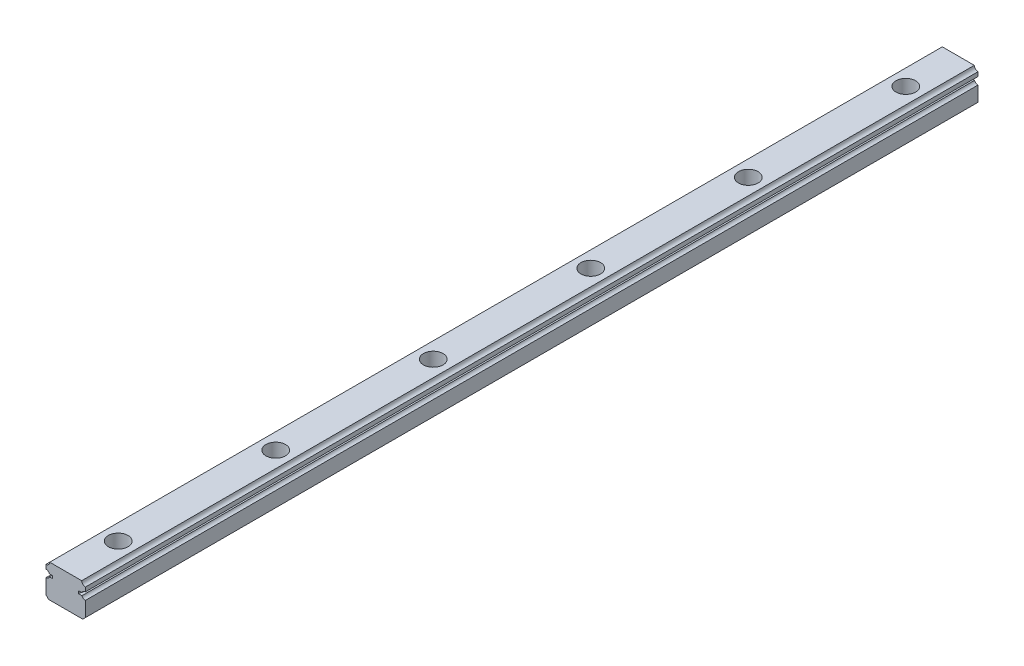
ISO-10303-21;
HEADER;
FILE_DESCRIPTION(('STEP AP214'),'2;1');
FILE_NAME('part.step','',(''),(''),'','','');
FILE_SCHEMA(('AUTOMOTIVE_DESIGN { 1 0 10303 214 1 1 1 1 }'));
ENDSEC;
DATA;
#1=APPLICATION_CONTEXT('core data for automotive mechanical design processes');
#2=APPLICATION_PROTOCOL_DEFINITION('international standard','automotive_design',2000,#1);
#3=PRODUCT_CONTEXT('',#1,'mechanical');
#4=PRODUCT('Part','Part','',(#3));
#5=PRODUCT_RELATED_PRODUCT_CATEGORY('part','',(#4));
#6=PRODUCT_DEFINITION_FORMATION('','',#4);
#7=PRODUCT_DEFINITION_CONTEXT('part definition',#1,'design');
#8=PRODUCT_DEFINITION('design','',#6,#7);
#9=PRODUCT_DEFINITION_SHAPE('','',#8);
#10=(LENGTH_UNIT() NAMED_UNIT(*) SI_UNIT(.MILLI.,.METRE.));
#11=(NAMED_UNIT(*) PLANE_ANGLE_UNIT() SI_UNIT($,.RADIAN.));
#12=(NAMED_UNIT(*) SI_UNIT($,.STERADIAN.) SOLID_ANGLE_UNIT());
#13=UNCERTAINTY_MEASURE_WITH_UNIT(LENGTH_MEASURE(1.E-05),#10,'distance_accuracy_value','');
#14=(GEOMETRIC_REPRESENTATION_CONTEXT(3) GLOBAL_UNCERTAINTY_ASSIGNED_CONTEXT((#13)) GLOBAL_UNIT_ASSIGNED_CONTEXT((#10,
#11,#12)) REPRESENTATION_CONTEXT('',''));
#15=CARTESIAN_POINT('',(0.,0.,0.));
#16=DIRECTION('',(0.,0.,1.));
#17=DIRECTION('',(1.,0.,0.));
#18=AXIS2_PLACEMENT_3D('',#15,#16,#17);
#19=CARTESIAN_POINT('',(-6.09998900000225,12.4999900000003,170.));
#20=DIRECTION('',(0.,-1.,0.));
#21=DIRECTION('',(1.,0.,0.));
#22=AXIS2_PLACEMENT_3D('',#19,#20,#21);
#23=PLANE('',#22);
#24=CARTESIAN_POINT('',(0.,12.4999900000003,29.9999999999999));
#25=DIRECTION('',(0.,1.,0.));
#26=DIRECTION('',(0.,0.,1.));
#27=AXIS2_PLACEMENT_3D('',#24,#25,#26);
#28=CIRCLE('',#27,3.74999999999998);
#29=CARTESIAN_POINT('',(0.,12.4999900000003,33.7499999999999));
#30=VERTEX_POINT('',#29);
#31=EDGE_CURVE('E784',#30,#30,#28,.T.);
#32=ORIENTED_EDGE('',*,*,#31,.F.);
#33=EDGE_LOOP('',(#32));
#34=FACE_BOUND('',#33,.T.);
#35=CARTESIAN_POINT('',(0.,12.4999900000003,-90.0000000000001));
#36=DIRECTION('',(0.,1.,0.));
#37=DIRECTION('',(0.,0.,1.));
#38=AXIS2_PLACEMENT_3D('',#35,#36,#37);
#39=CIRCLE('',#38,3.74999999999998);
#40=CARTESIAN_POINT('',(0.,12.4999900000003,-86.2500000000001));
#41=VERTEX_POINT('',#40);
#42=EDGE_CURVE('E813',#41,#41,#39,.T.);
#43=ORIENTED_EDGE('',*,*,#42,.F.);
#44=EDGE_LOOP('',(#43));
#45=FACE_BOUND('',#44,.T.);
#46=DIRECTION('',(-1.,0.,0.));
#47=VECTOR('',#46,1.);
#48=CARTESIAN_POINT('',(-6.09998900000225,12.4999900000003,-170.));
#49=LINE('',#48,#47);
#50=CARTESIAN_POINT('',(6.09998900000225,12.4999900000003,-170.));
#51=VERTEX_POINT('',#50);
#52=CARTESIAN_POINT('',(-6.09998900000225,12.4999900000003,-170.));
#53=VERTEX_POINT('',#52);
#54=EDGE_CURVE('E211',#51,#53,#49,.T.);
#55=ORIENTED_EDGE('',*,*,#54,.T.);
#56=DIRECTION('',(0.,0.,-1.));
#57=VECTOR('',#56,1.);
#58=CARTESIAN_POINT('',(-6.09998900000225,12.4999900000003,170.));
#59=LINE('',#58,#57);
#60=CARTESIAN_POINT('',(-6.09998900000225,12.4999900000003,170.));
#61=VERTEX_POINT('',#60);
#62=EDGE_CURVE('E282',#61,#53,#59,.T.);
#63=ORIENTED_EDGE('',*,*,#62,.F.);
#64=DIRECTION('',(-1.,0.,0.));
#65=VECTOR('',#64,1.);
#66=CARTESIAN_POINT('',(-6.09998900000225,12.4999900000003,170.));
#67=LINE('',#66,#65);
#68=CARTESIAN_POINT('',(6.09998900000225,12.4999900000003,170.));
#69=VERTEX_POINT('',#68);
#70=EDGE_CURVE('E311',#69,#61,#67,.T.);
#71=ORIENTED_EDGE('',*,*,#70,.F.);
#72=DIRECTION('',(0.,0.,-1.));
#73=VECTOR('',#72,1.);
#74=CARTESIAN_POINT('',(6.09998900000225,12.4999900000003,170.));
#75=LINE('',#74,#73);
#76=EDGE_CURVE('E285',#69,#51,#75,.T.);
#77=ORIENTED_EDGE('',*,*,#76,.T.);
#78=EDGE_LOOP('',(#55,#63,#71,#77));
#79=FACE_BOUND('',#78,.T.);
#80=CARTESIAN_POINT('',(0.,12.4999900000003,150.));
#81=DIRECTION('',(0.,-1.,0.));
#82=DIRECTION('',(0.,0.,-1.));
#83=AXIS2_PLACEMENT_3D('',#80,#81,#82);
#84=CIRCLE('',#83,3.74999999999998);
#85=CARTESIAN_POINT('',(0.,12.4999900000003,146.25));
#86=VERTEX_POINT('',#85);
#87=EDGE_CURVE('E207',#86,#86,#84,.T.);
#88=ORIENTED_EDGE('',*,*,#87,.T.);
#89=EDGE_LOOP('',(#88));
#90=FACE_BOUND('',#89,.T.);
#91=CARTESIAN_POINT('',(0.,12.4999900000003,-150.));
#92=DIRECTION('',(0.,1.,0.));
#93=DIRECTION('',(0.,0.,1.));
#94=AXIS2_PLACEMENT_3D('',#91,#92,#93);
#95=CIRCLE('',#94,3.74999999999998);
#96=CARTESIAN_POINT('',(0.,12.4999900000003,-146.25));
#97=VERTEX_POINT('',#96);
#98=EDGE_CURVE('E825',#97,#97,#95,.T.);
#99=ORIENTED_EDGE('',*,*,#98,.F.);
#100=EDGE_LOOP('',(#99));
#101=FACE_BOUND('',#100,.T.);
#102=CARTESIAN_POINT('',(0.,12.4999900000003,-30.0000000000001));
#103=DIRECTION('',(0.,1.,0.));
#104=DIRECTION('',(0.,0.,1.));
#105=AXIS2_PLACEMENT_3D('',#102,#103,#104);
#106=CIRCLE('',#105,3.74999999999998);
#107=CARTESIAN_POINT('',(0.,12.4999900000003,-26.2500000000001));
#108=VERTEX_POINT('',#107);
#109=EDGE_CURVE('E803',#108,#108,#106,.T.);
#110=ORIENTED_EDGE('',*,*,#109,.F.);
#111=EDGE_LOOP('',(#110));
#112=FACE_BOUND('',#111,.T.);
#113=CARTESIAN_POINT('',(0.,12.4999900000003,89.9999999999999));
#114=DIRECTION('',(0.,1.,0.));
#115=DIRECTION('',(0.,0.,1.));
#116=AXIS2_PLACEMENT_3D('',#113,#114,#115);
#117=CIRCLE('',#116,3.74999999999998);
#118=CARTESIAN_POINT('',(0.,12.4999900000003,93.7499999999999));
#119=VERTEX_POINT('',#118);
#120=EDGE_CURVE('E857',#119,#119,#117,.T.);
#121=ORIENTED_EDGE('',*,*,#120,.F.);
#122=EDGE_LOOP('',(#121));
#123=FACE_BOUND('',#122,.T.);
#124=ADVANCED_FACE('F34',(#34,#45,#79,#90,#101,#112,#123),#23,.F.);
#125=CARTESIAN_POINT('',(6.49996585786402,0.,170.));
#126=DIRECTION('',(0.,1.,0.));
#127=DIRECTION('',(0.,0.,1.));
#128=AXIS2_PLACEMENT_3D('',#125,#126,#127);
#129=PLANE('',#128);
#130=CARTESIAN_POINT('',(0.,0.,30.));
#131=DIRECTION('',(0.,1.,0.));
#132=DIRECTION('',(0.,0.,1.));
#133=AXIS2_PLACEMENT_3D('',#130,#131,#132);
#134=CIRCLE('',#133,2.24999999999997);
#135=CARTESIAN_POINT('',(0.,0.,32.2499999999999));
#136=VERTEX_POINT('',#135);
#137=EDGE_CURVE('E800',#136,#136,#134,.T.);
#138=ORIENTED_EDGE('',*,*,#137,.T.);
#139=EDGE_LOOP('',(#138));
#140=FACE_BOUND('',#139,.T.);
#141=CARTESIAN_POINT('',(0.,0.,-90.));
#142=DIRECTION('',(0.,1.,0.));
#143=DIRECTION('',(0.,0.,1.));
#144=AXIS2_PLACEMENT_3D('',#141,#142,#143);
#145=CIRCLE('',#144,2.24999999999997);
#146=CARTESIAN_POINT('',(0.,0.,-87.7500000000001));
#147=VERTEX_POINT('',#146);
#148=EDGE_CURVE('E822',#147,#147,#145,.T.);
#149=ORIENTED_EDGE('',*,*,#148,.T.);
#150=EDGE_LOOP('',(#149));
#151=FACE_BOUND('',#150,.T.);
#152=DIRECTION('',(1.,0.,0.));
#153=VECTOR('',#152,1.);
#154=CARTESIAN_POINT('',(6.49996585786402,0.,-170.));
#155=LINE('',#154,#153);
#156=CARTESIAN_POINT('',(-6.49996585786388,0.,-170.));
#157=VERTEX_POINT('',#156);
#158=CARTESIAN_POINT('',(6.49996585786402,0.,-170.));
#159=VERTEX_POINT('',#158);
#160=EDGE_CURVE('E231',#157,#159,#155,.T.);
#161=ORIENTED_EDGE('',*,*,#160,.T.);
#162=DIRECTION('',(0.,0.,-1.));
#163=VECTOR('',#162,1.);
#164=CARTESIAN_POINT('',(6.49996585786402,0.,170.));
#165=LINE('',#164,#163);
#166=CARTESIAN_POINT('',(6.49996585786402,0.,170.));
#167=VERTEX_POINT('',#166);
#168=EDGE_CURVE('E252',#167,#159,#165,.T.);
#169=ORIENTED_EDGE('',*,*,#168,.F.);
#170=DIRECTION('',(1.,0.,0.));
#171=VECTOR('',#170,1.);
#172=CARTESIAN_POINT('',(6.49996585786402,0.,170.));
#173=LINE('',#172,#171);
#174=CARTESIAN_POINT('',(-6.49996585786388,0.,170.));
#175=VERTEX_POINT('',#174);
#176=EDGE_CURVE('E331',#175,#167,#173,.T.);
#177=ORIENTED_EDGE('',*,*,#176,.F.);
#178=DIRECTION('',(0.,0.,-1.));
#179=VECTOR('',#178,1.);
#180=CARTESIAN_POINT('',(-6.49996585786388,0.,170.));
#181=LINE('',#180,#179);
#182=EDGE_CURVE('E255',#175,#157,#181,.T.);
#183=ORIENTED_EDGE('',*,*,#182,.T.);
#184=EDGE_LOOP('',(#161,#169,#177,#183));
#185=FACE_BOUND('',#184,.T.);
#186=CARTESIAN_POINT('',(0.,0.,150.));
#187=DIRECTION('',(0.,-1.,0.));
#188=DIRECTION('',(0.,0.,-1.));
#189=AXIS2_PLACEMENT_3D('',#186,#187,#188);
#190=CIRCLE('',#189,2.24999999999997);
#191=CARTESIAN_POINT('',(0.,0.,147.75));
#192=VERTEX_POINT('',#191);
#193=EDGE_CURVE('E771',#192,#192,#190,.T.);
#194=ORIENTED_EDGE('',*,*,#193,.F.);
#195=EDGE_LOOP('',(#194));
#196=FACE_BOUND('',#195,.T.);
#197=CARTESIAN_POINT('',(0.,0.,-150.));
#198=DIRECTION('',(0.,1.,0.));
#199=DIRECTION('',(0.,0.,1.));
#200=AXIS2_PLACEMENT_3D('',#197,#198,#199);
#201=CIRCLE('',#200,2.24999999999997);
#202=CARTESIAN_POINT('',(0.,0.,-147.75));
#203=VERTEX_POINT('',#202);
#204=EDGE_CURVE('E775',#203,#203,#201,.T.);
#205=ORIENTED_EDGE('',*,*,#204,.T.);
#206=EDGE_LOOP('',(#205));
#207=FACE_BOUND('',#206,.T.);
#208=CARTESIAN_POINT('',(0.,0.,-30.));
#209=DIRECTION('',(0.,1.,0.));
#210=DIRECTION('',(0.,0.,1.));
#211=AXIS2_PLACEMENT_3D('',#208,#209,#210);
#212=CIRCLE('',#211,2.24999999999997);
#213=CARTESIAN_POINT('',(0.,0.,-27.7500000000001));
#214=VERTEX_POINT('',#213);
#215=EDGE_CURVE('E779',#214,#214,#212,.T.);
#216=ORIENTED_EDGE('',*,*,#215,.T.);
#217=EDGE_LOOP('',(#216));
#218=FACE_BOUND('',#217,.T.);
#219=CARTESIAN_POINT('',(0.,0.,90.));
#220=DIRECTION('',(0.,1.,0.));
#221=DIRECTION('',(0.,0.,1.));
#222=AXIS2_PLACEMENT_3D('',#219,#220,#221);
#223=CIRCLE('',#222,2.24999999999997);
#224=CARTESIAN_POINT('',(0.,0.,92.2499999999999));
#225=VERTEX_POINT('',#224);
#226=EDGE_CURVE('E782',#225,#225,#223,.T.);
#227=ORIENTED_EDGE('',*,*,#226,.T.);
#228=EDGE_LOOP('',(#227));
#229=FACE_BOUND('',#228,.T.);
#230=ADVANCED_FACE('F360',(#140,#151,#185,#196,#207,#218,#229),#129,.F.);
#231=CARTESIAN_POINT('',(7.49999000000021,8.09999999996976,170.));
#232=DIRECTION('',(0.,0.,-1.));
#233=DIRECTION('',(-1.,0.,0.));
#234=AXIS2_PLACEMENT_3D('',#231,#232,#233);
#235=CYLINDRICAL_SURFACE('',#234,1.4);
#236=CARTESIAN_POINT('',(7.49999000000021,8.09999999996976,-170.));
#237=DIRECTION('',(0.,0.,-1.));
#238=DIRECTION('',(-1.,0.,0.));
#239=AXIS2_PLACEMENT_3D('',#236,#237,#238);
#240=CIRCLE('',#239,1.4);
#241=CARTESIAN_POINT('',(6.19232643481465,8.60001599999995,-170.));
#242=VERTEX_POINT('',#241);
#243=CARTESIAN_POINT('',(7.49998999999975,9.49999999996977,-170.));
#244=VERTEX_POINT('',#243);
#245=EDGE_CURVE('E203',#242,#244,#240,.T.);
#246=ORIENTED_EDGE('',*,*,#245,.T.);
#247=DIRECTION('',(0.,0.,-1.));
#248=VECTOR('',#247,1.);
#249=CARTESIAN_POINT('',(7.49998999999975,9.49999999996977,170.));
#250=LINE('',#249,#248);
#251=CARTESIAN_POINT('',(7.49998999999975,9.49999999996977,170.));
#252=VERTEX_POINT('',#251);
#253=EDGE_CURVE('E11',#252,#244,#250,.T.);
#254=ORIENTED_EDGE('',*,*,#253,.F.);
#255=CARTESIAN_POINT('',(7.49999000000021,8.09999999996976,170.));
#256=DIRECTION('',(0.,0.,-1.));
#257=DIRECTION('',(-1.,0.,0.));
#258=AXIS2_PLACEMENT_3D('',#255,#256,#257);
#259=CIRCLE('',#258,1.4);
#260=CARTESIAN_POINT('',(6.19232643481465,8.60001599999995,170.));
#261=VERTEX_POINT('',#260);
#262=EDGE_CURVE('E242',#261,#252,#259,.T.);
#263=ORIENTED_EDGE('',*,*,#262,.F.);
#264=DIRECTION('',(0.,0.,-1.));
#265=VECTOR('',#264,1.);
#266=CARTESIAN_POINT('',(6.19232643481465,8.60001599999995,170.));
#267=LINE('',#266,#265);
#268=EDGE_CURVE('E199',#261,#242,#267,.T.);
#269=ORIENTED_EDGE('',*,*,#268,.T.);
#270=EDGE_LOOP('',(#246,#254,#263,#269));
#271=FACE_BOUND('',#270,.T.);
#272=ADVANCED_FACE('F36',(#271),#235,.F.);
#273=CARTESIAN_POINT('',(7.49998999999975,11.0999740000294,170.));
#274=DIRECTION('',(-1.,0.,0.));
#275=DIRECTION('',(0.,-1.,0.));
#276=AXIS2_PLACEMENT_3D('',#273,#274,#275);
#277=PLANE('',#276);
#278=DIRECTION('',(0.,1.,0.));
#279=VECTOR('',#278,1.);
#280=CARTESIAN_POINT('',(7.49998999999975,11.0999740000294,-170.));
#281=LINE('',#280,#279);
#282=CARTESIAN_POINT('',(7.49998999999975,11.0999740000294,-170.));
#283=VERTEX_POINT('',#282);
#284=EDGE_CURVE('E206',#244,#283,#281,.T.);
#285=ORIENTED_EDGE('',*,*,#284,.T.);
#286=DIRECTION('',(0.,0.,-1.));
#287=VECTOR('',#286,1.);
#288=CARTESIAN_POINT('',(7.49998999999975,11.0999740000294,170.));
#289=LINE('',#288,#287);
#290=CARTESIAN_POINT('',(7.49998999999975,11.0999740000294,170.));
#291=VERTEX_POINT('',#290);
#292=EDGE_CURVE('E43',#291,#283,#289,.T.);
#293=ORIENTED_EDGE('',*,*,#292,.F.);
#294=DIRECTION('',(0.,1.,0.));
#295=VECTOR('',#294,1.);
#296=CARTESIAN_POINT('',(7.49998999999975,11.0999740000294,170.));
#297=LINE('',#296,#295);
#298=EDGE_CURVE('E130',#252,#291,#297,.T.);
#299=ORIENTED_EDGE('',*,*,#298,.F.);
#300=ORIENTED_EDGE('',*,*,#253,.T.);
#301=EDGE_LOOP('',(#285,#293,#299,#300));
#302=FACE_BOUND('',#301,.T.);
#303=ADVANCED_FACE('F374',(#302),#277,.F.);
#304=CARTESIAN_POINT('',(7.49999999999328,12.4999849999937,170.));
#305=DIRECTION('',(0.,0.,-1.));
#306=DIRECTION('',(-1.,0.,0.));
#307=AXIS2_PLACEMENT_3D('',#304,#305,#306);
#308=CYLINDRICAL_SURFACE('',#307,1.40001099999996);
#309=CARTESIAN_POINT('',(7.49999999999328,12.4999849999937,-170.));
#310=DIRECTION('',(0.,0.,-1.));
#311=DIRECTION('',(-1.,0.,0.));
#312=AXIS2_PLACEMENT_3D('',#309,#310,#311);
#313=CIRCLE('',#312,1.40001099999996);
#314=EDGE_CURVE('E209',#283,#51,#313,.T.);
#315=ORIENTED_EDGE('',*,*,#314,.T.);
#316=ORIENTED_EDGE('',*,*,#76,.F.);
#317=CARTESIAN_POINT('',(7.49999999999328,12.4999849999937,170.));
#318=DIRECTION('',(0.,0.,-1.));
#319=DIRECTION('',(-1.,0.,0.));
#320=AXIS2_PLACEMENT_3D('',#317,#318,#319);
#321=CIRCLE('',#320,1.40001099999996);
#322=EDGE_CURVE('E293',#291,#69,#321,.T.);
#323=ORIENTED_EDGE('',*,*,#322,.F.);
#324=ORIENTED_EDGE('',*,*,#292,.T.);
#325=EDGE_LOOP('',(#315,#316,#323,#324));
#326=FACE_BOUND('',#325,.T.);
#327=ADVANCED_FACE('F291',(#326),#308,.F.);
#328=CARTESIAN_POINT('',(-7.49999999999333,12.4999849999938,170.));
#329=DIRECTION('',(0.,0.,-1.));
#330=DIRECTION('',(-1.,0.,0.));
#331=AXIS2_PLACEMENT_3D('',#328,#329,#330);
#332=CYLINDRICAL_SURFACE('',#331,1.40001100000001);
#333=CARTESIAN_POINT('',(-7.49999999999333,12.4999849999938,-170.));
#334=DIRECTION('',(0.,0.,-1.));
#335=DIRECTION('',(-1.,0.,0.));
#336=AXIS2_PLACEMENT_3D('',#333,#334,#335);
#337=CIRCLE('',#336,1.40001100000001);
#338=CARTESIAN_POINT('',(-7.49998999999979,11.0999740000295,-170.));
#339=VERTEX_POINT('',#338);
#340=EDGE_CURVE('E213',#53,#339,#337,.T.);
#341=ORIENTED_EDGE('',*,*,#340,.T.);
#342=DIRECTION('',(0.,0.,-1.));
#343=VECTOR('',#342,1.);
#344=CARTESIAN_POINT('',(-7.49998999999979,11.0999740000295,170.));
#345=LINE('',#344,#343);
#346=CARTESIAN_POINT('',(-7.49998999999979,11.0999740000295,170.));
#347=VERTEX_POINT('',#346);
#348=EDGE_CURVE('E279',#347,#339,#345,.T.);
#349=ORIENTED_EDGE('',*,*,#348,.F.);
#350=CARTESIAN_POINT('',(-7.49999999999333,12.4999849999938,170.));
#351=DIRECTION('',(0.,0.,-1.));
#352=DIRECTION('',(-1.,0.,0.));
#353=AXIS2_PLACEMENT_3D('',#350,#351,#352);
#354=CIRCLE('',#353,1.40001100000001);
#355=EDGE_CURVE('E308',#61,#347,#354,.T.);
#356=ORIENTED_EDGE('',*,*,#355,.F.);
#357=ORIENTED_EDGE('',*,*,#62,.T.);
#358=EDGE_LOOP('',(#341,#349,#356,#357));
#359=FACE_BOUND('',#358,.T.);
#360=ADVANCED_FACE('F306',(#359),#332,.F.);
#361=CARTESIAN_POINT('',(-7.49998999999981,9.49999999994918,170.));
#362=DIRECTION('',(1.,0.,0.));
#363=DIRECTION('',(0.,1.,0.));
#364=AXIS2_PLACEMENT_3D('',#361,#362,#363);
#365=PLANE('',#364);
#366=DIRECTION('',(0.,-1.,0.));
#367=VECTOR('',#366,1.);
#368=CARTESIAN_POINT('',(-7.49998999999981,9.49999999994918,-170.));
#369=LINE('',#368,#367);
#370=CARTESIAN_POINT('',(-7.49998999999981,9.49999999994918,-170.));
#371=VERTEX_POINT('',#370);
#372=EDGE_CURVE('E215',#339,#371,#369,.T.);
#373=ORIENTED_EDGE('',*,*,#372,.T.);
#374=DIRECTION('',(0.,0.,-1.));
#375=VECTOR('',#374,1.);
#376=CARTESIAN_POINT('',(-7.49998999999981,9.49999999994918,170.));
#377=LINE('',#376,#375);
#378=CARTESIAN_POINT('',(-7.49998999999981,9.49999999994918,170.));
#379=VERTEX_POINT('',#378);
#380=EDGE_CURVE('E276',#379,#371,#377,.T.);
#381=ORIENTED_EDGE('',*,*,#380,.F.);
#382=DIRECTION('',(0.,-1.,0.));
#383=VECTOR('',#382,1.);
#384=CARTESIAN_POINT('',(-7.49998999999981,9.49999999994918,170.));
#385=LINE('',#384,#383);
#386=EDGE_CURVE('E310',#347,#379,#385,.T.);
#387=ORIENTED_EDGE('',*,*,#386,.F.);
#388=ORIENTED_EDGE('',*,*,#348,.T.);
#389=EDGE_LOOP('',(#373,#381,#387,#388));
#390=FACE_BOUND('',#389,.T.);
#391=ADVANCED_FACE('F698',(#390),#365,.F.);
#392=CARTESIAN_POINT('',(-7.49998999999982,8.09999999994918,170.));
#393=DIRECTION('',(0.,0.,-1.));
#394=DIRECTION('',(-1.,0.,0.));
#395=AXIS2_PLACEMENT_3D('',#392,#393,#394);
#396=CYLINDRICAL_SURFACE('',#395,1.4);
#397=CARTESIAN_POINT('',(-7.49998999999982,8.09999999994918,-170.));
#398=DIRECTION('',(0.,0.,-1.));
#399=DIRECTION('',(-1.,0.,0.));
#400=AXIS2_PLACEMENT_3D('',#397,#398,#399);
#401=CIRCLE('',#400,1.4);
#402=CARTESIAN_POINT('',(-6.19232643481046,8.60001599996944,-170.));
#403=VERTEX_POINT('',#402);
#404=EDGE_CURVE('E217',#371,#403,#401,.T.);
#405=ORIENTED_EDGE('',*,*,#404,.T.);
#406=DIRECTION('',(0.,0.,-1.));
#407=VECTOR('',#406,1.);
#408=CARTESIAN_POINT('',(-6.19232643481046,8.60001599996944,170.));
#409=LINE('',#408,#407);
#410=CARTESIAN_POINT('',(-6.19232643481046,8.60001599996944,170.));
#411=VERTEX_POINT('',#410);
#412=EDGE_CURVE('E273',#411,#403,#409,.T.);
#413=ORIENTED_EDGE('',*,*,#412,.F.);
#414=CARTESIAN_POINT('',(-7.49998999999982,8.09999999994918,170.));
#415=DIRECTION('',(0.,0.,-1.));
#416=DIRECTION('',(-1.,0.,0.));
#417=AXIS2_PLACEMENT_3D('',#414,#415,#416);
#418=CIRCLE('',#417,1.4);
#419=EDGE_CURVE('E313',#379,#411,#418,.T.);
#420=ORIENTED_EDGE('',*,*,#419,.F.);
#421=ORIENTED_EDGE('',*,*,#380,.T.);
#422=EDGE_LOOP('',(#405,#413,#420,#421));
#423=FACE_BOUND('',#422,.T.);
#424=ADVANCED_FACE('F689',(#423),#396,.F.);
#425=CARTESIAN_POINT('',(-4.94997199999982,8.60000600000019,170.));
#426=DIRECTION('',(8.04920799129945E-06,0.999999999967605,0.));
#427=DIRECTION('',(-0.999999999967605,8.04920799129945E-06,0.));
#428=AXIS2_PLACEMENT_3D('',#425,#426,#427);
#429=PLANE('',#428);
#430=DIRECTION('',(0.999999999967605,-8.04920799129945E-06,0.));
#431=VECTOR('',#430,1.);
#432=CARTESIAN_POINT('',(-4.94997199999982,8.60000600000019,-170.));
#433=LINE('',#432,#431);
#434=CARTESIAN_POINT('',(-4.94997199999982,8.60000600000019,-170.));
#435=VERTEX_POINT('',#434);
#436=EDGE_CURVE('E219',#403,#435,#433,.T.);
#437=ORIENTED_EDGE('',*,*,#436,.T.);
#438=DIRECTION('',(0.,0.,-1.));
#439=VECTOR('',#438,1.);
#440=CARTESIAN_POINT('',(-4.94997199999982,8.60000600000019,170.));
#441=LINE('',#440,#439);
#442=CARTESIAN_POINT('',(-4.94997199999982,8.60000600000019,170.));
#443=VERTEX_POINT('',#442);
#444=EDGE_CURVE('E270',#443,#435,#441,.T.);
#445=ORIENTED_EDGE('',*,*,#444,.F.);
#446=DIRECTION('',(0.999999999967605,-8.04920799129945E-06,0.));
#447=VECTOR('',#446,1.);
#448=CARTESIAN_POINT('',(-4.94997199999982,8.60000600000019,170.));
#449=LINE('',#448,#447);
#450=EDGE_CURVE('E319',#411,#443,#449,.T.);
#451=ORIENTED_EDGE('',*,*,#450,.F.);
#452=ORIENTED_EDGE('',*,*,#412,.T.);
#453=EDGE_LOOP('',(#437,#445,#451,#452));
#454=FACE_BOUND('',#453,.T.);
#455=ADVANCED_FACE('F680',(#454),#429,.F.);
#456=CARTESIAN_POINT('',(-4.9499819999998,7.59999600000017,170.));
#457=DIRECTION('',(0.999999999950001,-9.99989999003211E-06,0.));
#458=DIRECTION('',(9.99989999003211E-06,0.999999999950001,0.));
#459=AXIS2_PLACEMENT_3D('',#456,#457,#458);
#460=PLANE('',#459);
#461=DIRECTION('',(-9.99989999003211E-06,-0.999999999950001,0.));
#462=VECTOR('',#461,1.);
#463=CARTESIAN_POINT('',(-4.9499819999998,7.59999600000017,-170.));
#464=LINE('',#463,#462);
#465=CARTESIAN_POINT('',(-4.9499819999998,7.59999600000017,-170.));
#466=VERTEX_POINT('',#465);
#467=EDGE_CURVE('E221',#435,#466,#464,.T.);
#468=ORIENTED_EDGE('',*,*,#467,.T.);
#469=DIRECTION('',(0.,0.,-1.));
#470=VECTOR('',#469,1.);
#471=CARTESIAN_POINT('',(-4.9499819999998,7.59999600000017,170.));
#472=LINE('',#471,#470);
#473=CARTESIAN_POINT('',(-4.9499819999998,7.59999600000017,170.));
#474=VERTEX_POINT('',#473);
#475=EDGE_CURVE('E267',#474,#466,#472,.T.);
#476=ORIENTED_EDGE('',*,*,#475,.F.);
#477=DIRECTION('',(-9.99989999003211E-06,-0.999999999950001,0.));
#478=VECTOR('',#477,1.);
#479=CARTESIAN_POINT('',(-4.9499819999998,7.59999600000017,170.));
#480=LINE('',#479,#478);
#481=EDGE_CURVE('E321',#443,#474,#480,.T.);
#482=ORIENTED_EDGE('',*,*,#481,.F.);
#483=ORIENTED_EDGE('',*,*,#444,.T.);
#484=EDGE_LOOP('',(#468,#476,#482,#483));
#485=FACE_BOUND('',#484,.T.);
#486=ADVANCED_FACE('F671',(#485),#460,.F.);
#487=CARTESIAN_POINT('',(-6.19232184636335,7.59999600000018,170.));
#488=DIRECTION('',(0.,-1.,0.));
#489=DIRECTION('',(1.,0.,0.));
#490=AXIS2_PLACEMENT_3D('',#487,#488,#489);
#491=PLANE('',#490);
#492=DIRECTION('',(-1.,0.,0.));
#493=VECTOR('',#492,1.);
#494=CARTESIAN_POINT('',(-6.19232184636335,7.59999600000018,-170.));
#495=LINE('',#494,#493);
#496=CARTESIAN_POINT('',(-6.19232184636335,7.59999600000018,-170.));
#497=VERTEX_POINT('',#496);
#498=EDGE_CURVE('E223',#466,#497,#495,.T.);
#499=ORIENTED_EDGE('',*,*,#498,.T.);
#500=DIRECTION('',(0.,0.,-1.));
#501=VECTOR('',#500,1.);
#502=CARTESIAN_POINT('',(-6.19232184636335,7.59999600000018,170.));
#503=LINE('',#502,#501);
#504=CARTESIAN_POINT('',(-6.19232184636335,7.59999600000018,170.));
#505=VERTEX_POINT('',#504);
#506=EDGE_CURVE('E264',#505,#497,#503,.T.);
#507=ORIENTED_EDGE('',*,*,#506,.F.);
#508=DIRECTION('',(-1.,0.,0.));
#509=VECTOR('',#508,1.);
#510=CARTESIAN_POINT('',(-6.19232184636335,7.59999600000018,170.));
#511=LINE('',#510,#509);
#512=EDGE_CURVE('E323',#474,#505,#511,.T.);
#513=ORIENTED_EDGE('',*,*,#512,.F.);
#514=ORIENTED_EDGE('',*,*,#475,.T.);
#515=EDGE_LOOP('',(#499,#507,#513,#514));
#516=FACE_BOUND('',#515,.T.);
#517=ADVANCED_FACE('F662',(#516),#491,.F.);
#518=CARTESIAN_POINT('',(-7.49998999999982,8.09999999994918,170.));
#519=DIRECTION('',(0.,0.,-1.));
#520=DIRECTION('',(-1.,0.,0.));
#521=AXIS2_PLACEMENT_3D('',#518,#519,#520);
#522=CYLINDRICAL_SURFACE('',#521,1.40000000000001);
#523=CARTESIAN_POINT('',(-7.49998999999982,8.09999999994918,-170.));
#524=DIRECTION('',(0.,0.,-1.));
#525=DIRECTION('',(-1.,0.,0.));
#526=AXIS2_PLACEMENT_3D('',#523,#524,#525);
#527=CIRCLE('',#526,1.40000000000001);
#528=CARTESIAN_POINT('',(-7.49998999999966,6.69999999994918,-170.));
#529=VERTEX_POINT('',#528);
#530=EDGE_CURVE('E225',#497,#529,#527,.T.);
#531=ORIENTED_EDGE('',*,*,#530,.T.);
#532=DIRECTION('',(0.,0.,-1.));
#533=VECTOR('',#532,1.);
#534=CARTESIAN_POINT('',(-7.49998999999966,6.69999999994918,170.));
#535=LINE('',#534,#533);
#536=CARTESIAN_POINT('',(-7.49998999999966,6.69999999994918,170.));
#537=VERTEX_POINT('',#536);
#538=EDGE_CURVE('E261',#537,#529,#535,.T.);
#539=ORIENTED_EDGE('',*,*,#538,.F.);
#540=CARTESIAN_POINT('',(-7.49998999999982,8.09999999994918,170.));
#541=DIRECTION('',(0.,0.,-1.));
#542=DIRECTION('',(-1.,0.,0.));
#543=AXIS2_PLACEMENT_3D('',#540,#541,#542);
#544=CIRCLE('',#543,1.40000000000001);
#545=EDGE_CURVE('E325',#505,#537,#544,.T.);
#546=ORIENTED_EDGE('',*,*,#545,.F.);
#547=ORIENTED_EDGE('',*,*,#506,.T.);
#548=EDGE_LOOP('',(#531,#539,#546,#547));
#549=FACE_BOUND('',#548,.T.);
#550=ADVANCED_FACE('F653',(#549),#522,.F.);
#551=CARTESIAN_POINT('',(-7.49998999999966,1.00002414213572,170.));
#552=DIRECTION('',(1.,0.,0.));
#553=DIRECTION('',(0.,1.,0.));
#554=AXIS2_PLACEMENT_3D('',#551,#552,#553);
#555=PLANE('',#554);
#556=DIRECTION('',(0.,-1.,0.));
#557=VECTOR('',#556,1.);
#558=CARTESIAN_POINT('',(-7.49998999999966,1.00002414213572,-170.));
#559=LINE('',#558,#557);
#560=CARTESIAN_POINT('',(-7.49998999999966,1.00002414213572,-170.));
#561=VERTEX_POINT('',#560);
#562=EDGE_CURVE('E227',#529,#561,#559,.T.);
#563=ORIENTED_EDGE('',*,*,#562,.T.);
#564=DIRECTION('',(0.,0.,-1.));
#565=VECTOR('',#564,1.);
#566=CARTESIAN_POINT('',(-7.49998999999966,1.00002414213572,170.));
#567=LINE('',#566,#565);
#568=CARTESIAN_POINT('',(-7.49998999999966,1.00002414213572,170.));
#569=VERTEX_POINT('',#568);
#570=EDGE_CURVE('E258',#569,#561,#567,.T.);
#571=ORIENTED_EDGE('',*,*,#570,.F.);
#572=DIRECTION('',(0.,-1.,0.));
#573=VECTOR('',#572,1.);
#574=CARTESIAN_POINT('',(-7.49998999999966,1.00002414213572,170.));
#575=LINE('',#574,#573);
#576=EDGE_CURVE('E327',#537,#569,#575,.T.);
#577=ORIENTED_EDGE('',*,*,#576,.F.);
#578=ORIENTED_EDGE('',*,*,#538,.T.);
#579=EDGE_LOOP('',(#563,#571,#577,#578));
#580=FACE_BOUND('',#579,.T.);
#581=ADVANCED_FACE('F644',(#580),#555,.F.);
#582=CARTESIAN_POINT('',(-6.49996585786388,0.,170.));
#583=DIRECTION('',(0.707106781186547,0.707106781186547,0.));
#584=DIRECTION('',(-0.707106781186548,0.707106781186548,0.));
#585=AXIS2_PLACEMENT_3D('',#582,#583,#584);
#586=PLANE('',#585);
#587=DIRECTION('',(0.707106781186548,-0.707106781186548,0.));
#588=VECTOR('',#587,1.);
#589=CARTESIAN_POINT('',(-6.49996585786388,0.,-170.));
#590=LINE('',#589,#588);
#591=EDGE_CURVE('E229',#561,#157,#590,.T.);
#592=ORIENTED_EDGE('',*,*,#591,.T.);
#593=ORIENTED_EDGE('',*,*,#182,.F.);
#594=DIRECTION('',(0.707106781186548,-0.707106781186548,0.));
#595=VECTOR('',#594,1.);
#596=CARTESIAN_POINT('',(-6.49996585786388,0.,170.));
#597=LINE('',#596,#595);
#598=EDGE_CURVE('E329',#569,#175,#597,.T.);
#599=ORIENTED_EDGE('',*,*,#598,.F.);
#600=ORIENTED_EDGE('',*,*,#570,.T.);
#601=EDGE_LOOP('',(#592,#593,#599,#600));
#602=FACE_BOUND('',#601,.T.);
#603=ADVANCED_FACE('F635',(#602),#586,.F.);
#604=CARTESIAN_POINT('',(7.49999,1.00002414213591,170.));
#605=DIRECTION('',(-0.707106781186548,0.707106781186547,0.));
#606=DIRECTION('',(-0.707106781186547,-0.707106781186548,0.));
#607=AXIS2_PLACEMENT_3D('',#604,#605,#606);
#608=PLANE('',#607);
#609=DIRECTION('',(0.707106781186547,0.707106781186548,0.));
#610=VECTOR('',#609,1.);
#611=CARTESIAN_POINT('',(7.49999,1.00002414213591,-170.));
#612=LINE('',#611,#610);
#613=CARTESIAN_POINT('',(7.49999,1.00002414213591,-170.));
#614=VERTEX_POINT('',#613);
#615=EDGE_CURVE('E233',#159,#614,#612,.T.);
#616=ORIENTED_EDGE('',*,*,#615,.T.);
#617=DIRECTION('',(0.,0.,-1.));
#618=VECTOR('',#617,1.);
#619=CARTESIAN_POINT('',(7.49999,1.00002414213591,170.));
#620=LINE('',#619,#618);
#621=CARTESIAN_POINT('',(7.49999,1.00002414213591,170.));
#622=VERTEX_POINT('',#621);
#623=EDGE_CURVE('E249',#622,#614,#620,.T.);
#624=ORIENTED_EDGE('',*,*,#623,.F.);
#625=DIRECTION('',(0.707106781186547,0.707106781186548,0.));
#626=VECTOR('',#625,1.);
#627=CARTESIAN_POINT('',(7.49999,1.00002414213591,170.));
#628=LINE('',#627,#626);
#629=EDGE_CURVE('E333',#167,#622,#628,.T.);
#630=ORIENTED_EDGE('',*,*,#629,.F.);
#631=ORIENTED_EDGE('',*,*,#168,.T.);
#632=EDGE_LOOP('',(#616,#624,#630,#631));
#633=FACE_BOUND('',#632,.T.);
#634=ADVANCED_FACE('F627',(#633),#608,.F.);
#635=CARTESIAN_POINT('',(7.49999,6.69999999996978,170.));
#636=DIRECTION('',(-1.,0.,0.));
#637=DIRECTION('',(0.,0.,1.));
#638=AXIS2_PLACEMENT_3D('',#635,#636,#637);
#639=PLANE('',#638);
#640=DIRECTION('',(0.,1.,0.));
#641=VECTOR('',#640,1.);
#642=CARTESIAN_POINT('',(7.49999,6.69999999996978,-170.));
#643=LINE('',#642,#641);
#644=CARTESIAN_POINT('',(7.49999,6.69999999996978,-170.));
#645=VERTEX_POINT('',#644);
#646=EDGE_CURVE('E235',#614,#645,#643,.T.);
#647=ORIENTED_EDGE('',*,*,#646,.T.);
#648=DIRECTION('',(0.,0.,-1.));
#649=VECTOR('',#648,1.);
#650=CARTESIAN_POINT('',(7.49999,6.69999999996978,170.));
#651=LINE('',#650,#649);
#652=CARTESIAN_POINT('',(7.49999,6.69999999996978,170.));
#653=VERTEX_POINT('',#652);
#654=EDGE_CURVE('E246',#653,#645,#651,.T.);
#655=ORIENTED_EDGE('',*,*,#654,.F.);
#656=DIRECTION('',(0.,1.,0.));
#657=VECTOR('',#656,1.);
#658=CARTESIAN_POINT('',(7.49999,6.69999999996978,170.));
#659=LINE('',#658,#657);
#660=EDGE_CURVE('E335',#622,#653,#659,.T.);
#661=ORIENTED_EDGE('',*,*,#660,.F.);
#662=ORIENTED_EDGE('',*,*,#623,.T.);
#663=EDGE_LOOP('',(#647,#655,#661,#662));
#664=FACE_BOUND('',#663,.T.);
#665=ADVANCED_FACE('F341',(#664),#639,.F.);
#666=CARTESIAN_POINT('',(7.49999000000021,8.09999999996976,170.));
#667=DIRECTION('',(0.,0.,-1.));
#668=DIRECTION('',(-1.,0.,0.));
#669=AXIS2_PLACEMENT_3D('',#666,#667,#668);
#670=CYLINDRICAL_SURFACE('',#669,1.39999999999998);
#671=CARTESIAN_POINT('',(7.49999000000021,8.09999999996976,-170.));
#672=DIRECTION('',(0.,0.,-1.));
#673=DIRECTION('',(-1.,0.,0.));
#674=AXIS2_PLACEMENT_3D('',#671,#672,#673);
#675=CIRCLE('',#674,1.39999999999998);
#676=CARTESIAN_POINT('',(6.19232184638777,7.599995999958,-170.));
#677=VERTEX_POINT('',#676);
#678=EDGE_CURVE('E237',#645,#677,#675,.T.);
#679=ORIENTED_EDGE('',*,*,#678,.T.);
#680=DIRECTION('',(0.,0.,-1.));
#681=VECTOR('',#680,1.);
#682=CARTESIAN_POINT('',(6.19232184638777,7.599995999958,170.));
#683=LINE('',#682,#681);
#684=CARTESIAN_POINT('',(6.19232184638777,7.599995999958,170.));
#685=VERTEX_POINT('',#684);
#686=EDGE_CURVE('E194',#685,#677,#683,.T.);
#687=ORIENTED_EDGE('',*,*,#686,.F.);
#688=CARTESIAN_POINT('',(7.49999000000021,8.09999999996976,170.));
#689=DIRECTION('',(0.,0.,-1.));
#690=DIRECTION('',(-1.,0.,0.));
#691=AXIS2_PLACEMENT_3D('',#688,#689,#690);
#692=CIRCLE('',#691,1.39999999999998);
#693=EDGE_CURVE('E185',#653,#685,#692,.T.);
#694=ORIENTED_EDGE('',*,*,#693,.F.);
#695=ORIENTED_EDGE('',*,*,#654,.T.);
#696=EDGE_LOOP('',(#679,#687,#694,#695));
#697=FACE_BOUND('',#696,.T.);
#698=ADVANCED_FACE('F345',(#697),#670,.F.);
#699=CARTESIAN_POINT('',(4.94997200000024,7.60000599999994,170.));
#700=DIRECTION('',(-8.04929623135913E-06,-0.999999999967604,0.));
#701=DIRECTION('',(0.999999999967605,-8.04929623135913E-06,0.));
#702=AXIS2_PLACEMENT_3D('',#699,#700,#701);
#703=PLANE('',#702);
#704=DIRECTION('',(-0.999999999967604,8.04929623135913E-06,0.));
#705=VECTOR('',#704,1.);
#706=CARTESIAN_POINT('',(4.94997200000024,7.60000599999994,-170.));
#707=LINE('',#706,#705);
#708=CARTESIAN_POINT('',(4.94997200000024,7.60000599999994,-170.));
#709=VERTEX_POINT('',#708);
#710=EDGE_CURVE('E193',#677,#709,#707,.T.);
#711=ORIENTED_EDGE('',*,*,#710,.T.);
#712=DIRECTION('',(0.,0.,-1.));
#713=VECTOR('',#712,1.);
#714=CARTESIAN_POINT('',(4.94997200000024,7.60000599999994,170.));
#715=LINE('',#714,#713);
#716=CARTESIAN_POINT('',(4.94997200000024,7.60000599999994,170.));
#717=VERTEX_POINT('',#716);
#718=EDGE_CURVE('E190',#717,#709,#715,.T.);
#719=ORIENTED_EDGE('',*,*,#718,.F.);
#720=DIRECTION('',(-0.999999999967604,8.04929623135913E-06,0.));
#721=VECTOR('',#720,1.);
#722=CARTESIAN_POINT('',(4.94997200000024,7.60000599999994,170.));
#723=LINE('',#722,#721);
#724=EDGE_CURVE('E179',#685,#717,#723,.T.);
#725=ORIENTED_EDGE('',*,*,#724,.F.);
#726=ORIENTED_EDGE('',*,*,#686,.T.);
#727=EDGE_LOOP('',(#711,#719,#725,#726));
#728=FACE_BOUND('',#727,.T.);
#729=ADVANCED_FACE('F191',(#728),#703,.F.);
#730=CARTESIAN_POINT('',(4.94998200000026,8.60001599999997,170.));
#731=DIRECTION('',(-0.999999999950001,9.9999000160527E-06,0.));
#732=DIRECTION('',(-9.99990001605271E-06,-0.999999999950001,0.));
#733=AXIS2_PLACEMENT_3D('',#730,#731,#732);
#734=PLANE('',#733);
#735=DIRECTION('',(9.9999000160527E-06,0.999999999950001,0.));
#736=VECTOR('',#735,1.);
#737=CARTESIAN_POINT('',(4.94998200000026,8.60001599999997,-170.));
#738=LINE('',#737,#736);
#739=CARTESIAN_POINT('',(4.94998200000026,8.60001599999997,-170.));
#740=VERTEX_POINT('',#739);
#741=EDGE_CURVE('E116',#709,#740,#738,.T.);
#742=ORIENTED_EDGE('',*,*,#741,.T.);
#743=DIRECTION('',(0.,0.,-1.));
#744=VECTOR('',#743,1.);
#745=CARTESIAN_POINT('',(4.94998200000026,8.60001599999997,170.));
#746=LINE('',#745,#744);
#747=CARTESIAN_POINT('',(4.94998200000026,8.60001599999997,170.));
#748=VERTEX_POINT('',#747);
#749=EDGE_CURVE('E195',#748,#740,#746,.T.);
#750=ORIENTED_EDGE('',*,*,#749,.F.);
#751=DIRECTION('',(9.9999000160527E-06,0.999999999950001,0.));
#752=VECTOR('',#751,1.);
#753=CARTESIAN_POINT('',(4.94998200000026,8.60001599999997,170.));
#754=LINE('',#753,#752);
#755=EDGE_CURVE('E183',#717,#748,#754,.T.);
#756=ORIENTED_EDGE('',*,*,#755,.F.);
#757=ORIENTED_EDGE('',*,*,#718,.T.);
#758=EDGE_LOOP('',(#742,#750,#756,#757));
#759=FACE_BOUND('',#758,.T.);
#760=ADVANCED_FACE('F197',(#759),#734,.F.);
#761=CARTESIAN_POINT('',(6.19232643481465,8.60001599999995,170.));
#762=DIRECTION('',(0.,1.,0.));
#763=DIRECTION('',(-1.,0.,0.));
#764=AXIS2_PLACEMENT_3D('',#761,#762,#763);
#765=PLANE('',#764);
#766=DIRECTION('',(1.,0.,0.));
#767=VECTOR('',#766,1.);
#768=CARTESIAN_POINT('',(6.19232643481465,8.60001599999995,-170.));
#769=LINE('',#768,#767);
#770=EDGE_CURVE('E122',#740,#242,#769,.T.);
#771=ORIENTED_EDGE('',*,*,#770,.T.);
#772=ORIENTED_EDGE('',*,*,#268,.F.);
#773=DIRECTION('',(1.,0.,0.));
#774=VECTOR('',#773,1.);
#775=CARTESIAN_POINT('',(6.19232643481465,8.60001599999995,170.));
#776=LINE('',#775,#774);
#777=EDGE_CURVE('E51',#748,#261,#776,.T.);
#778=ORIENTED_EDGE('',*,*,#777,.F.);
#779=ORIENTED_EDGE('',*,*,#749,.T.);
#780=EDGE_LOOP('',(#771,#772,#778,#779));
#781=FACE_BOUND('',#780,.T.);
#782=ADVANCED_FACE('F349',(#781),#765,.F.);
#783=CARTESIAN_POINT('',(7.49999000000021,8.09999999996976,170.));
#784=DIRECTION('',(0.,0.,-1.));
#785=DIRECTION('',(-1.,0.,0.));
#786=AXIS2_PLACEMENT_3D('',#783,#784,#785);
#787=PLANE('',#786);
#788=ORIENTED_EDGE('',*,*,#262,.T.);
#789=ORIENTED_EDGE('',*,*,#298,.T.);
#790=ORIENTED_EDGE('',*,*,#322,.T.);
#791=ORIENTED_EDGE('',*,*,#70,.T.);
#792=ORIENTED_EDGE('',*,*,#355,.T.);
#793=ORIENTED_EDGE('',*,*,#386,.T.);
#794=ORIENTED_EDGE('',*,*,#419,.T.);
#795=ORIENTED_EDGE('',*,*,#450,.T.);
#796=ORIENTED_EDGE('',*,*,#481,.T.);
#797=ORIENTED_EDGE('',*,*,#512,.T.);
#798=ORIENTED_EDGE('',*,*,#545,.T.);
#799=ORIENTED_EDGE('',*,*,#576,.T.);
#800=ORIENTED_EDGE('',*,*,#598,.T.);
#801=ORIENTED_EDGE('',*,*,#176,.T.);
#802=ORIENTED_EDGE('',*,*,#629,.T.);
#803=ORIENTED_EDGE('',*,*,#660,.T.);
#804=ORIENTED_EDGE('',*,*,#693,.T.);
#805=ORIENTED_EDGE('',*,*,#724,.T.);
#806=ORIENTED_EDGE('',*,*,#755,.T.);
#807=ORIENTED_EDGE('',*,*,#777,.T.);
#808=EDGE_LOOP('',(#788,#789,#790,#791,#792,#793,#794,#795,#796,#797,#798,#799,#800,#801,#802,
#803,#804,#805,#806,#807));
#809=FACE_BOUND('',#808,.T.);
#810=ADVANCED_FACE('F181',(#809),#787,.F.);
#811=CARTESIAN_POINT('',(7.49999000000021,8.09999999996976,-170.));
#812=DIRECTION('',(0.,0.,-1.));
#813=DIRECTION('',(-1.,0.,0.));
#814=AXIS2_PLACEMENT_3D('',#811,#812,#813);
#815=PLANE('',#814);
#816=ORIENTED_EDGE('',*,*,#245,.F.);
#817=ORIENTED_EDGE('',*,*,#770,.F.);
#818=ORIENTED_EDGE('',*,*,#741,.F.);
#819=ORIENTED_EDGE('',*,*,#710,.F.);
#820=ORIENTED_EDGE('',*,*,#678,.F.);
#821=ORIENTED_EDGE('',*,*,#646,.F.);
#822=ORIENTED_EDGE('',*,*,#615,.F.);
#823=ORIENTED_EDGE('',*,*,#160,.F.);
#824=ORIENTED_EDGE('',*,*,#591,.F.);
#825=ORIENTED_EDGE('',*,*,#562,.F.);
#826=ORIENTED_EDGE('',*,*,#530,.F.);
#827=ORIENTED_EDGE('',*,*,#498,.F.);
#828=ORIENTED_EDGE('',*,*,#467,.F.);
#829=ORIENTED_EDGE('',*,*,#436,.F.);
#830=ORIENTED_EDGE('',*,*,#404,.F.);
#831=ORIENTED_EDGE('',*,*,#372,.F.);
#832=ORIENTED_EDGE('',*,*,#340,.F.);
#833=ORIENTED_EDGE('',*,*,#54,.F.);
#834=ORIENTED_EDGE('',*,*,#314,.F.);
#835=ORIENTED_EDGE('',*,*,#284,.F.);
#836=EDGE_LOOP('',(#816,#817,#818,#819,#820,#821,#822,#823,#824,#825,#826,#827,#828,#829,#830,
#831,#832,#833,#834,#835));
#837=FACE_BOUND('',#836,.T.);
#838=ADVANCED_FACE('F297',(#837),#815,.T.);
#839=CARTESIAN_POINT('',(0.,0.,150.));
#840=DIRECTION('',(0.,-1.,0.));
#841=DIRECTION('',(0.,0.,-1.));
#842=AXIS2_PLACEMENT_3D('',#839,#840,#841);
#843=CYLINDRICAL_SURFACE('',#842,3.74999999999998);
#844=ORIENTED_EDGE('',*,*,#87,.F.);
#845=EDGE_LOOP('',(#844));
#846=FACE_BOUND('',#845,.T.);
#847=CARTESIAN_POINT('',(0.,7.19999000000028,150.));
#848=DIRECTION('',(0.,-1.,0.));
#849=DIRECTION('',(0.,0.,-1.));
#850=AXIS2_PLACEMENT_3D('',#847,#848,#849);
#851=CIRCLE('',#850,3.74999999999998);
#852=CARTESIAN_POINT('',(0.,7.19999000000028,146.25));
#853=VERTEX_POINT('',#852);
#854=EDGE_CURVE('E839',#853,#853,#851,.T.);
#855=ORIENTED_EDGE('',*,*,#854,.T.);
#856=EDGE_LOOP('',(#855));
#857=FACE_BOUND('',#856,.T.);
#858=ADVANCED_FACE('F541',(#846,#857),#843,.F.);
#859=CARTESIAN_POINT('',(0.,7.19999000000028,146.25));
#860=DIRECTION('',(0.,-1.,0.));
#861=DIRECTION('',(0.,0.,-1.));
#862=AXIS2_PLACEMENT_3D('',#859,#860,#861);
#863=PLANE('',#862);
#864=ORIENTED_EDGE('',*,*,#854,.F.);
#865=EDGE_LOOP('',(#864));
#866=FACE_BOUND('',#865,.T.);
#867=CARTESIAN_POINT('',(0.,7.19999000000028,150.));
#868=DIRECTION('',(0.,-1.,0.));
#869=DIRECTION('',(0.,0.,-1.));
#870=AXIS2_PLACEMENT_3D('',#867,#868,#869);
#871=CIRCLE('',#870,2.24999999999997);
#872=CARTESIAN_POINT('',(0.,7.19999000000028,147.75));
#873=VERTEX_POINT('',#872);
#874=EDGE_CURVE('E836',#873,#873,#871,.T.);
#875=ORIENTED_EDGE('',*,*,#874,.T.);
#876=EDGE_LOOP('',(#875));
#877=FACE_BOUND('',#876,.T.);
#878=ADVANCED_FACE('F537',(#866,#877),#863,.F.);
#879=CARTESIAN_POINT('',(0.,0.,150.));
#880=DIRECTION('',(0.,-1.,0.));
#881=DIRECTION('',(0.,0.,-1.));
#882=AXIS2_PLACEMENT_3D('',#879,#880,#881);
#883=CYLINDRICAL_SURFACE('',#882,2.24999999999997);
#884=ORIENTED_EDGE('',*,*,#874,.F.);
#885=EDGE_LOOP('',(#884));
#886=FACE_BOUND('',#885,.T.);
#887=ORIENTED_EDGE('',*,*,#193,.T.);
#888=EDGE_LOOP('',(#887));
#889=FACE_BOUND('',#888,.T.);
#890=ADVANCED_FACE('F533',(#886,#889),#883,.F.);
#891=CARTESIAN_POINT('',(0.,12.4999900000003,-150.));
#892=DIRECTION('',(0.,1.,0.));
#893=DIRECTION('',(0.,0.,1.));
#894=AXIS2_PLACEMENT_3D('',#891,#892,#893);
#895=CYLINDRICAL_SURFACE('',#894,2.24999999999996);
#896=CARTESIAN_POINT('',(0.,7.19999000000031,-150.));
#897=DIRECTION('',(0.,1.,0.));
#898=DIRECTION('',(0.,0.,1.));
#899=AXIS2_PLACEMENT_3D('',#896,#897,#898);
#900=CIRCLE('',#899,2.24999999999996);
#901=CARTESIAN_POINT('',(0.,7.19999000000031,-147.75));
#902=VERTEX_POINT('',#901);
#903=EDGE_CURVE('E831',#902,#902,#900,.T.);
#904=ORIENTED_EDGE('',*,*,#903,.T.);
#905=EDGE_LOOP('',(#904));
#906=FACE_BOUND('',#905,.T.);
#907=ORIENTED_EDGE('',*,*,#204,.F.);
#908=EDGE_LOOP('',(#907));
#909=FACE_BOUND('',#908,.T.);
#910=ADVANCED_FACE('F529',(#906,#909),#895,.F.);
#911=CARTESIAN_POINT('',(0.,7.1999900000003,-152.25));
#912=DIRECTION('',(0.,1.,0.));
#913=DIRECTION('',(0.,0.,1.));
#914=AXIS2_PLACEMENT_3D('',#911,#912,#913);
#915=PLANE('',#914);
#916=CARTESIAN_POINT('',(0.,7.19999000000031,-150.));
#917=DIRECTION('',(0.,1.,0.));
#918=DIRECTION('',(0.,0.,1.));
#919=AXIS2_PLACEMENT_3D('',#916,#917,#918);
#920=CIRCLE('',#919,3.74999999999999);
#921=CARTESIAN_POINT('',(0.,7.19999000000032,-146.25));
#922=VERTEX_POINT('',#921);
#923=EDGE_CURVE('E828',#922,#922,#920,.T.);
#924=ORIENTED_EDGE('',*,*,#923,.T.);
#925=EDGE_LOOP('',(#924));
#926=FACE_BOUND('',#925,.T.);
#927=ORIENTED_EDGE('',*,*,#903,.F.);
#928=EDGE_LOOP('',(#927));
#929=FACE_BOUND('',#928,.T.);
#930=ADVANCED_FACE('F525',(#926,#929),#915,.T.);
#931=CARTESIAN_POINT('',(0.,12.4999900000003,-150.));
#932=DIRECTION('',(0.,1.,0.));
#933=DIRECTION('',(0.,0.,1.));
#934=AXIS2_PLACEMENT_3D('',#931,#932,#933);
#935=CYLINDRICAL_SURFACE('',#934,3.74999999999998);
#936=ORIENTED_EDGE('',*,*,#98,.T.);
#937=EDGE_LOOP('',(#936));
#938=FACE_BOUND('',#937,.T.);
#939=ORIENTED_EDGE('',*,*,#923,.F.);
#940=EDGE_LOOP('',(#939));
#941=FACE_BOUND('',#940,.T.);
#942=ADVANCED_FACE('F401',(#938,#941),#935,.F.);
#943=CARTESIAN_POINT('',(0.,12.4999900000003,-90.0000000000001));
#944=DIRECTION('',(0.,1.,0.));
#945=DIRECTION('',(0.,0.,1.));
#946=AXIS2_PLACEMENT_3D('',#943,#944,#945);
#947=CYLINDRICAL_SURFACE('',#946,2.24999999999996);
#948=CARTESIAN_POINT('',(0.,7.19999000000031,-90.0000000000001));
#949=DIRECTION('',(0.,1.,0.));
#950=DIRECTION('',(0.,0.,1.));
#951=AXIS2_PLACEMENT_3D('',#948,#949,#950);
#952=CIRCLE('',#951,2.24999999999996);
#953=CARTESIAN_POINT('',(0.,7.19999000000031,-87.7500000000001));
#954=VERTEX_POINT('',#953);
#955=EDGE_CURVE('E819',#954,#954,#952,.T.);
#956=ORIENTED_EDGE('',*,*,#955,.T.);
#957=EDGE_LOOP('',(#956));
#958=FACE_BOUND('',#957,.T.);
#959=ORIENTED_EDGE('',*,*,#148,.F.);
#960=EDGE_LOOP('',(#959));
#961=FACE_BOUND('',#960,.T.);
#962=ADVANCED_FACE('F394',(#958,#961),#947,.F.);
#963=CARTESIAN_POINT('',(0.,7.1999900000003,-92.25));
#964=DIRECTION('',(0.,1.,0.));
#965=DIRECTION('',(0.,0.,1.));
#966=AXIS2_PLACEMENT_3D('',#963,#964,#965);
#967=PLANE('',#966);
#968=CARTESIAN_POINT('',(0.,7.19999000000031,-90.0000000000001));
#969=DIRECTION('',(0.,1.,0.));
#970=DIRECTION('',(0.,0.,1.));
#971=AXIS2_PLACEMENT_3D('',#968,#969,#970);
#972=CIRCLE('',#971,3.74999999999999);
#973=CARTESIAN_POINT('',(0.,7.19999000000032,-86.2500000000001));
#974=VERTEX_POINT('',#973);
#975=EDGE_CURVE('E816',#974,#974,#972,.T.);
#976=ORIENTED_EDGE('',*,*,#975,.T.);
#977=EDGE_LOOP('',(#976));
#978=FACE_BOUND('',#977,.T.);
#979=ORIENTED_EDGE('',*,*,#955,.F.);
#980=EDGE_LOOP('',(#979));
#981=FACE_BOUND('',#980,.T.);
#982=ADVANCED_FACE('F400',(#978,#981),#967,.T.);
#983=CARTESIAN_POINT('',(0.,12.4999900000003,-90.0000000000001));
#984=DIRECTION('',(0.,1.,0.));
#985=DIRECTION('',(0.,0.,1.));
#986=AXIS2_PLACEMENT_3D('',#983,#984,#985);
#987=CYLINDRICAL_SURFACE('',#986,3.74999999999998);
#988=ORIENTED_EDGE('',*,*,#42,.T.);
#989=EDGE_LOOP('',(#988));
#990=FACE_BOUND('',#989,.T.);
#991=ORIENTED_EDGE('',*,*,#975,.F.);
#992=EDGE_LOOP('',(#991));
#993=FACE_BOUND('',#992,.T.);
#994=ADVANCED_FACE('F412',(#990,#993),#987,.F.);
#995=CARTESIAN_POINT('',(0.,12.4999900000003,-30.0000000000001));
#996=DIRECTION('',(0.,1.,0.));
#997=DIRECTION('',(0.,0.,1.));
#998=AXIS2_PLACEMENT_3D('',#995,#996,#997);
#999=CYLINDRICAL_SURFACE('',#998,2.24999999999996);
#1000=CARTESIAN_POINT('',(0.,7.19999000000031,-30.0000000000001));
#1001=DIRECTION('',(0.,1.,0.));
#1002=DIRECTION('',(0.,0.,1.));
#1003=AXIS2_PLACEMENT_3D('',#1000,#1001,#1002);
#1004=CIRCLE('',#1003,2.24999999999996);
#1005=CARTESIAN_POINT('',(0.,7.19999000000031,-27.7500000000001));
#1006=VERTEX_POINT('',#1005);
#1007=EDGE_CURVE('E809',#1006,#1006,#1004,.T.);
#1008=ORIENTED_EDGE('',*,*,#1007,.T.);
#1009=EDGE_LOOP('',(#1008));
#1010=FACE_BOUND('',#1009,.T.);
#1011=ORIENTED_EDGE('',*,*,#215,.F.);
#1012=EDGE_LOOP('',(#1011));
#1013=FACE_BOUND('',#1012,.T.);
#1014=ADVANCED_FACE('F424',(#1010,#1013),#999,.F.);
#1015=CARTESIAN_POINT('',(0.,7.1999900000003,-32.25));
#1016=DIRECTION('',(0.,1.,0.));
#1017=DIRECTION('',(0.,0.,1.));
#1018=AXIS2_PLACEMENT_3D('',#1015,#1016,#1017);
#1019=PLANE('',#1018);
#1020=CARTESIAN_POINT('',(0.,7.19999000000031,-30.0000000000001));
#1021=DIRECTION('',(0.,1.,0.));
#1022=DIRECTION('',(0.,0.,1.));
#1023=AXIS2_PLACEMENT_3D('',#1020,#1021,#1022);
#1024=CIRCLE('',#1023,3.74999999999999);
#1025=CARTESIAN_POINT('',(0.,7.19999000000032,-26.2500000000001));
#1026=VERTEX_POINT('',#1025);
#1027=EDGE_CURVE('E806',#1026,#1026,#1024,.T.);
#1028=ORIENTED_EDGE('',*,*,#1027,.T.);
#1029=EDGE_LOOP('',(#1028));
#1030=FACE_BOUND('',#1029,.T.);
#1031=ORIENTED_EDGE('',*,*,#1007,.F.);
#1032=EDGE_LOOP('',(#1031));
#1033=FACE_BOUND('',#1032,.T.);
#1034=ADVANCED_FACE('F435',(#1030,#1033),#1019,.T.);
#1035=CARTESIAN_POINT('',(0.,12.4999900000003,-30.0000000000001));
#1036=DIRECTION('',(0.,1.,0.));
#1037=DIRECTION('',(0.,0.,1.));
#1038=AXIS2_PLACEMENT_3D('',#1035,#1036,#1037);
#1039=CYLINDRICAL_SURFACE('',#1038,3.74999999999998);
#1040=ORIENTED_EDGE('',*,*,#109,.T.);
#1041=EDGE_LOOP('',(#1040));
#1042=FACE_BOUND('',#1041,.T.);
#1043=ORIENTED_EDGE('',*,*,#1027,.F.);
#1044=EDGE_LOOP('',(#1043));
#1045=FACE_BOUND('',#1044,.T.);
#1046=ADVANCED_FACE('F446',(#1042,#1045),#1039,.F.);
#1047=CARTESIAN_POINT('',(0.,12.4999900000003,29.9999999999999));
#1048=DIRECTION('',(0.,1.,0.));
#1049=DIRECTION('',(0.,0.,1.));
#1050=AXIS2_PLACEMENT_3D('',#1047,#1048,#1049);
#1051=CYLINDRICAL_SURFACE('',#1050,2.24999999999996);
#1052=CARTESIAN_POINT('',(0.,7.19999000000031,29.9999999999999));
#1053=DIRECTION('',(0.,1.,0.));
#1054=DIRECTION('',(0.,0.,1.));
#1055=AXIS2_PLACEMENT_3D('',#1052,#1053,#1054);
#1056=CIRCLE('',#1055,2.24999999999996);
#1057=CARTESIAN_POINT('',(0.,7.19999000000031,32.2499999999999));
#1058=VERTEX_POINT('',#1057);
#1059=EDGE_CURVE('E797',#1058,#1058,#1056,.T.);
#1060=ORIENTED_EDGE('',*,*,#1059,.T.);
#1061=EDGE_LOOP('',(#1060));
#1062=FACE_BOUND('',#1061,.T.);
#1063=ORIENTED_EDGE('',*,*,#137,.F.);
#1064=EDGE_LOOP('',(#1063));
#1065=FACE_BOUND('',#1064,.T.);
#1066=ADVANCED_FACE('F456',(#1062,#1065),#1051,.F.);
#1067=CARTESIAN_POINT('',(0.,7.1999900000003,27.75));
#1068=DIRECTION('',(0.,1.,0.));
#1069=DIRECTION('',(0.,0.,1.));
#1070=AXIS2_PLACEMENT_3D('',#1067,#1068,#1069);
#1071=PLANE('',#1070);
#1072=CARTESIAN_POINT('',(0.,7.19999000000031,29.9999999999999));
#1073=DIRECTION('',(0.,1.,0.));
#1074=DIRECTION('',(0.,0.,1.));
#1075=AXIS2_PLACEMENT_3D('',#1072,#1073,#1074);
#1076=CIRCLE('',#1075,3.74999999999999);
#1077=CARTESIAN_POINT('',(0.,7.19999000000032,33.7499999999999));
#1078=VERTEX_POINT('',#1077);
#1079=EDGE_CURVE('E788',#1078,#1078,#1076,.T.);
#1080=ORIENTED_EDGE('',*,*,#1079,.T.);
#1081=EDGE_LOOP('',(#1080));
#1082=FACE_BOUND('',#1081,.T.);
#1083=ORIENTED_EDGE('',*,*,#1059,.F.);
#1084=EDGE_LOOP('',(#1083));
#1085=FACE_BOUND('',#1084,.T.);
#1086=ADVANCED_FACE('F466',(#1082,#1085),#1071,.T.);
#1087=CARTESIAN_POINT('',(0.,12.4999900000003,29.9999999999999));
#1088=DIRECTION('',(0.,1.,0.));
#1089=DIRECTION('',(0.,0.,1.));
#1090=AXIS2_PLACEMENT_3D('',#1087,#1088,#1089);
#1091=CYLINDRICAL_SURFACE('',#1090,3.74999999999998);
#1092=ORIENTED_EDGE('',*,*,#31,.T.);
#1093=EDGE_LOOP('',(#1092));
#1094=FACE_BOUND('',#1093,.T.);
#1095=ORIENTED_EDGE('',*,*,#1079,.F.);
#1096=EDGE_LOOP('',(#1095));
#1097=FACE_BOUND('',#1096,.T.);
#1098=ADVANCED_FACE('F476',(#1094,#1097),#1091,.F.);
#1099=CARTESIAN_POINT('',(0.,12.4999900000003,89.9999999999999));
#1100=DIRECTION('',(0.,1.,0.));
#1101=DIRECTION('',(0.,0.,1.));
#1102=AXIS2_PLACEMENT_3D('',#1099,#1100,#1101);
#1103=CYLINDRICAL_SURFACE('',#1102,2.24999999999996);
#1104=CARTESIAN_POINT('',(0.,7.19999000000031,89.9999999999999));
#1105=DIRECTION('',(0.,1.,0.));
#1106=DIRECTION('',(0.,0.,1.));
#1107=AXIS2_PLACEMENT_3D('',#1104,#1105,#1106);
#1108=CIRCLE('',#1107,2.24999999999996);
#1109=CARTESIAN_POINT('',(0.,7.19999000000031,92.2499999999999));
#1110=VERTEX_POINT('',#1109);
#1111=EDGE_CURVE('E785',#1110,#1110,#1108,.T.);
#1112=ORIENTED_EDGE('',*,*,#1111,.T.);
#1113=EDGE_LOOP('',(#1112));
#1114=FACE_BOUND('',#1113,.T.);
#1115=ORIENTED_EDGE('',*,*,#226,.F.);
#1116=EDGE_LOOP('',(#1115));
#1117=FACE_BOUND('',#1116,.T.);
#1118=ADVANCED_FACE('F486',(#1114,#1117),#1103,.F.);
#1119=CARTESIAN_POINT('',(0.,7.1999900000003,87.75));
#1120=DIRECTION('',(0.,1.,0.));
#1121=DIRECTION('',(0.,0.,1.));
#1122=AXIS2_PLACEMENT_3D('',#1119,#1120,#1121);
#1123=PLANE('',#1122);
#1124=CARTESIAN_POINT('',(0.,7.19999000000031,89.9999999999999));
#1125=DIRECTION('',(0.,1.,0.));
#1126=DIRECTION('',(0.,0.,1.));
#1127=AXIS2_PLACEMENT_3D('',#1124,#1125,#1126);
#1128=CIRCLE('',#1127,3.74999999999999);
#1129=CARTESIAN_POINT('',(0.,7.19999000000032,93.7499999999999));
#1130=VERTEX_POINT('',#1129);
#1131=EDGE_CURVE('E791',#1130,#1130,#1128,.T.);
#1132=ORIENTED_EDGE('',*,*,#1131,.T.);
#1133=EDGE_LOOP('',(#1132));
#1134=FACE_BOUND('',#1133,.T.);
#1135=ORIENTED_EDGE('',*,*,#1111,.F.);
#1136=EDGE_LOOP('',(#1135));
#1137=FACE_BOUND('',#1136,.T.);
#1138=ADVANCED_FACE('F496',(#1134,#1137),#1123,.T.);
#1139=CARTESIAN_POINT('',(0.,12.4999900000003,89.9999999999999));
#1140=DIRECTION('',(0.,1.,0.));
#1141=DIRECTION('',(0.,0.,1.));
#1142=AXIS2_PLACEMENT_3D('',#1139,#1140,#1141);
#1143=CYLINDRICAL_SURFACE('',#1142,3.74999999999998);
#1144=ORIENTED_EDGE('',*,*,#120,.T.);
#1145=EDGE_LOOP('',(#1144));
#1146=FACE_BOUND('',#1145,.T.);
#1147=ORIENTED_EDGE('',*,*,#1131,.F.);
#1148=EDGE_LOOP('',(#1147));
#1149=FACE_BOUND('',#1148,.T.);
#1150=ADVANCED_FACE('F506',(#1146,#1149),#1143,.F.);
#1151=CLOSED_SHELL('',(#124,#230,#272,#303,#327,#360,#391,#424,#455,#486,#517,#550,#581,#603,
#634,#665,#698,#729,#760,#782,#810,#838,#858,#878,#890,#910,#930,#942,#962,#982,#994,#1014,
#1034,#1046,#1066,#1086,#1098,#1118,#1138,#1150));
#1152=MANIFOLD_SOLID_BREP('B2',#1151);
#1153=ADVANCED_BREP_SHAPE_REPRESENTATION('',(#18,#1152),#14);
#1154=SHAPE_DEFINITION_REPRESENTATION(#9,#1153);
ENDSEC;
END-ISO-10303-21;
